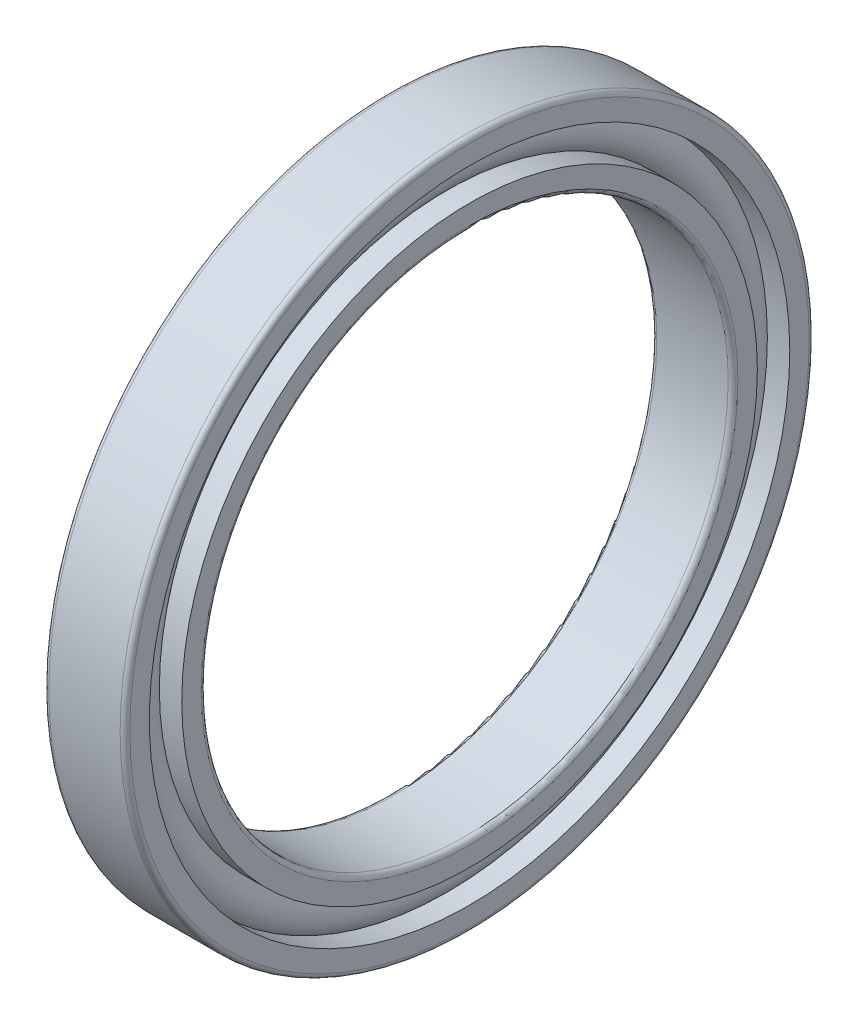
ISO-10303-21;
HEADER;
FILE_DESCRIPTION(('STEP AP214'),'2;1');
FILE_NAME('part.step','',(''),(''),'','','');
FILE_SCHEMA(('AUTOMOTIVE_DESIGN { 1 0 10303 214 1 1 1 1 }'));
ENDSEC;
DATA;
#1=APPLICATION_CONTEXT('core data for automotive mechanical design processes');
#2=APPLICATION_PROTOCOL_DEFINITION('international standard','automotive_design',2000,#1);
#3=PRODUCT_CONTEXT('',#1,'mechanical');
#4=PRODUCT('Part','Part','',(#3));
#5=PRODUCT_RELATED_PRODUCT_CATEGORY('part','',(#4));
#6=PRODUCT_DEFINITION_FORMATION('','',#4);
#7=PRODUCT_DEFINITION_CONTEXT('part definition',#1,'design');
#8=PRODUCT_DEFINITION('design','',#6,#7);
#9=PRODUCT_DEFINITION_SHAPE('','',#8);
#10=(LENGTH_UNIT() NAMED_UNIT(*) SI_UNIT(.MILLI.,.METRE.));
#11=(NAMED_UNIT(*) PLANE_ANGLE_UNIT() SI_UNIT($,.RADIAN.));
#12=(NAMED_UNIT(*) SI_UNIT($,.STERADIAN.) SOLID_ANGLE_UNIT());
#13=UNCERTAINTY_MEASURE_WITH_UNIT(LENGTH_MEASURE(1.E-05),#10,'distance_accuracy_value','');
#14=(GEOMETRIC_REPRESENTATION_CONTEXT(3) GLOBAL_UNCERTAINTY_ASSIGNED_CONTEXT((#13)) GLOBAL_UNIT_ASSIGNED_CONTEXT((#10,
#11,#12)) REPRESENTATION_CONTEXT('',''));
#15=CARTESIAN_POINT('',(0.,0.,0.));
#16=DIRECTION('',(0.,0.,1.));
#17=DIRECTION('',(1.,0.,0.));
#18=AXIS2_PLACEMENT_3D('',#15,#16,#17);
#19=CARTESIAN_POINT('',(0.,0.,0.));
#20=DIRECTION('',(-1.,0.,0.));
#21=DIRECTION('',(0.,0.,1.));
#22=AXIS2_PLACEMENT_3D('',#19,#20,#21);
#23=TOROIDAL_SURFACE('',#22,37.5,3.);
#24=CARTESIAN_POINT('',(2.23606797749978,0.,0.));
#25=DIRECTION('',(-1.,0.,0.));
#26=DIRECTION('',(0.,0.,1.));
#27=AXIS2_PLACEMENT_3D('',#24,#25,#26);
#28=CIRCLE('',#27,39.5);
#29=CARTESIAN_POINT('',(2.23606797749978,0.,39.5));
#30=VERTEX_POINT('',#29);
#31=EDGE_CURVE('E35',#30,#30,#28,.F.);
#32=ORIENTED_EDGE('',*,*,#31,.T.);
#33=EDGE_LOOP('',(#32));
#34=FACE_BOUND('',#33,.T.);
#35=CARTESIAN_POINT('',(2.23606797749978,0.,0.));
#36=DIRECTION('',(-1.,0.,0.));
#37=DIRECTION('',(0.,0.,1.));
#38=AXIS2_PLACEMENT_3D('',#35,#36,#37);
#39=CIRCLE('',#38,35.5);
#40=CARTESIAN_POINT('',(2.23606797749978,0.,35.5));
#41=VERTEX_POINT('',#40);
#42=EDGE_CURVE('E10',#41,#41,#39,.T.);
#43=ORIENTED_EDGE('',*,*,#42,.T.);
#44=EDGE_LOOP('',(#43));
#45=FACE_BOUND('',#44,.T.);
#46=ADVANCED_FACE('F31',(#34,#45),#23,.T.);
#47=CARTESIAN_POINT('',(-20.6375,0.,0.));
#48=DIRECTION('',(1.,0.,0.));
#49=DIRECTION('',(0.,0.,-1.));
#50=AXIS2_PLACEMENT_3D('',#47,#48,#49);
#51=CYLINDRICAL_SURFACE('',#50,35.5);
#52=CARTESIAN_POINT('',(5.,0.,0.));
#53=DIRECTION('',(1.,0.,0.));
#54=DIRECTION('',(0.,0.,-1.));
#55=AXIS2_PLACEMENT_3D('',#52,#53,#54);
#56=CIRCLE('',#55,35.5);
#57=CARTESIAN_POINT('',(5.,0.,-35.5));
#58=VERTEX_POINT('',#57);
#59=EDGE_CURVE('E44',#58,#58,#56,.T.);
#60=ORIENTED_EDGE('',*,*,#59,.F.);
#61=EDGE_LOOP('',(#60));
#62=FACE_BOUND('',#61,.T.);
#63=ORIENTED_EDGE('',*,*,#42,.F.);
#64=EDGE_LOOP('',(#63));
#65=FACE_BOUND('',#64,.T.);
#66=ADVANCED_FACE('F83',(#62,#65),#51,.T.);
#67=CARTESIAN_POINT('',(-20.6375,0.,0.));
#68=DIRECTION('',(1.,0.,0.));
#69=DIRECTION('',(0.,0.,-1.));
#70=AXIS2_PLACEMENT_3D('',#67,#68,#69);
#71=CYLINDRICAL_SURFACE('',#70,35.5);
#72=CARTESIAN_POINT('',(-5.,0.,0.));
#73=DIRECTION('',(1.,0.,0.));
#74=DIRECTION('',(0.,0.,-1.));
#75=AXIS2_PLACEMENT_3D('',#72,#73,#74);
#76=CIRCLE('',#75,35.5);
#77=CARTESIAN_POINT('',(-5.,0.,-35.5));
#78=VERTEX_POINT('',#77);
#79=EDGE_CURVE('E53',#78,#78,#76,.T.);
#80=ORIENTED_EDGE('',*,*,#79,.T.);
#81=EDGE_LOOP('',(#80));
#82=FACE_BOUND('',#81,.T.);
#83=CARTESIAN_POINT('',(-2.23606797749978,0.,0.));
#84=DIRECTION('',(1.,0.,0.));
#85=DIRECTION('',(0.,0.,-1.));
#86=AXIS2_PLACEMENT_3D('',#83,#84,#85);
#87=CIRCLE('',#86,35.5);
#88=CARTESIAN_POINT('',(-2.23606797749978,0.,-35.5));
#89=VERTEX_POINT('',#88);
#90=EDGE_CURVE('E39',#89,#89,#87,.T.);
#91=ORIENTED_EDGE('',*,*,#90,.F.);
#92=EDGE_LOOP('',(#91));
#93=FACE_BOUND('',#92,.T.);
#94=ADVANCED_FACE('F86',(#82,#93),#71,.T.);
#95=CARTESIAN_POINT('',(5.,33.1,0.));
#96=DIRECTION('',(1.,0.,0.));
#97=DIRECTION('',(0.,0.,-1.));
#98=AXIS2_PLACEMENT_3D('',#95,#96,#97);
#99=PLANE('',#98);
#100=ORIENTED_EDGE('',*,*,#59,.T.);
#101=EDGE_LOOP('',(#100));
#102=FACE_BOUND('',#101,.T.);
#103=CARTESIAN_POINT('',(5.,0.,0.));
#104=DIRECTION('',(1.,0.,0.));
#105=DIRECTION('',(0.,0.,-1.));
#106=AXIS2_PLACEMENT_3D('',#103,#104,#105);
#107=CIRCLE('',#106,33.1);
#108=CARTESIAN_POINT('',(5.,0.,-33.1));
#109=VERTEX_POINT('',#108);
#110=EDGE_CURVE('E75',#109,#109,#107,.T.);
#111=ORIENTED_EDGE('',*,*,#110,.F.);
#112=EDGE_LOOP('',(#111));
#113=FACE_BOUND('',#112,.T.);
#114=ADVANCED_FACE('F80',(#102,#113),#99,.T.);
#115=CARTESIAN_POINT('',(4.4,0.,0.));
#116=DIRECTION('',(1.,0.,0.));
#117=DIRECTION('',(0.,0.,-1.));
#118=AXIS2_PLACEMENT_3D('',#115,#116,#117);
#119=TOROIDAL_SURFACE('',#118,33.1,0.600000000000001);
#120=ORIENTED_EDGE('',*,*,#110,.T.);
#121=EDGE_LOOP('',(#120));
#122=FACE_BOUND('',#121,.T.);
#123=CARTESIAN_POINT('',(4.4,0.,0.));
#124=DIRECTION('',(1.,0.,0.));
#125=DIRECTION('',(0.,0.,-1.));
#126=AXIS2_PLACEMENT_3D('',#123,#124,#125);
#127=CIRCLE('',#126,32.5);
#128=CARTESIAN_POINT('',(4.4,0.,-32.5));
#129=VERTEX_POINT('',#128);
#130=EDGE_CURVE('E72',#129,#129,#127,.T.);
#131=ORIENTED_EDGE('',*,*,#130,.F.);
#132=EDGE_LOOP('',(#131));
#133=FACE_BOUND('',#132,.T.);
#134=ADVANCED_FACE('F97',(#122,#133),#119,.T.);
#135=CARTESIAN_POINT('',(-20.6375,0.,0.));
#136=DIRECTION('',(1.,0.,0.));
#137=DIRECTION('',(0.,0.,-1.));
#138=AXIS2_PLACEMENT_3D('',#135,#136,#137);
#139=CYLINDRICAL_SURFACE('',#138,32.5);
#140=ORIENTED_EDGE('',*,*,#130,.T.);
#141=EDGE_LOOP('',(#140));
#142=FACE_BOUND('',#141,.T.);
#143=CARTESIAN_POINT('',(-4.4,0.,0.));
#144=DIRECTION('',(1.,0.,0.));
#145=DIRECTION('',(0.,0.,-1.));
#146=AXIS2_PLACEMENT_3D('',#143,#144,#145);
#147=CIRCLE('',#146,32.5);
#148=CARTESIAN_POINT('',(-4.4,0.,-32.5));
#149=VERTEX_POINT('',#148);
#150=EDGE_CURVE('E69',#149,#149,#147,.T.);
#151=ORIENTED_EDGE('',*,*,#150,.F.);
#152=EDGE_LOOP('',(#151));
#153=FACE_BOUND('',#152,.T.);
#154=ADVANCED_FACE('F100',(#142,#153),#139,.F.);
#155=CARTESIAN_POINT('',(-4.4,0.,0.));
#156=DIRECTION('',(1.,0.,0.));
#157=DIRECTION('',(0.,0.,-1.));
#158=AXIS2_PLACEMENT_3D('',#155,#156,#157);
#159=TOROIDAL_SURFACE('',#158,33.1,0.600000000000001);
#160=ORIENTED_EDGE('',*,*,#150,.T.);
#161=EDGE_LOOP('',(#160));
#162=FACE_BOUND('',#161,.T.);
#163=CARTESIAN_POINT('',(-5.,0.,0.));
#164=DIRECTION('',(1.,0.,0.));
#165=DIRECTION('',(0.,0.,-1.));
#166=AXIS2_PLACEMENT_3D('',#163,#164,#165);
#167=CIRCLE('',#166,33.1);
#168=CARTESIAN_POINT('',(-5.,0.,-33.1));
#169=VERTEX_POINT('',#168);
#170=EDGE_CURVE('E66',#169,#169,#167,.T.);
#171=ORIENTED_EDGE('',*,*,#170,.F.);
#172=EDGE_LOOP('',(#171));
#173=FACE_BOUND('',#172,.T.);
#174=ADVANCED_FACE('F104',(#162,#173),#159,.T.);
#175=CARTESIAN_POINT('',(-5.,35.5,0.));
#176=DIRECTION('',(-1.,0.,0.));
#177=DIRECTION('',(0.,0.,1.));
#178=AXIS2_PLACEMENT_3D('',#175,#176,#177);
#179=PLANE('',#178);
#180=ORIENTED_EDGE('',*,*,#170,.T.);
#181=EDGE_LOOP('',(#180));
#182=FACE_BOUND('',#181,.T.);
#183=ORIENTED_EDGE('',*,*,#79,.F.);
#184=EDGE_LOOP('',(#183));
#185=FACE_BOUND('',#184,.T.);
#186=ADVANCED_FACE('F108',(#182,#185),#179,.T.);
#187=CARTESIAN_POINT('',(-2.23606797749978,0.,0.));
#188=DIRECTION('',(1.,0.,0.));
#189=DIRECTION('',(0.,0.,-1.));
#190=AXIS2_PLACEMENT_3D('',#187,#188,#189);
#191=CIRCLE('',#190,39.5);
#192=CARTESIAN_POINT('',(-2.23606797749978,0.,-39.5));
#193=VERTEX_POINT('',#192);
#194=EDGE_CURVE('E47',#193,#193,#191,.F.);
#195=ORIENTED_EDGE('',*,*,#194,.T.);
#196=EDGE_LOOP('',(#195));
#197=FACE_BOUND('',#196,.T.);
#198=ORIENTED_EDGE('',*,*,#90,.T.);
#199=EDGE_LOOP('',(#198));
#200=FACE_BOUND('',#199,.T.);
#201=ADVANCED_FACE('F33',(#197,#200),#23,.T.);
#202=CARTESIAN_POINT('',(-20.6375,0.,0.));
#203=DIRECTION('',(1.,0.,0.));
#204=DIRECTION('',(0.,0.,-1.));
#205=AXIS2_PLACEMENT_3D('',#202,#203,#204);
#206=CYLINDRICAL_SURFACE('',#205,39.5);
#207=CARTESIAN_POINT('',(5.,0.,0.));
#208=DIRECTION('',(1.,0.,0.));
#209=DIRECTION('',(0.,0.,-1.));
#210=AXIS2_PLACEMENT_3D('',#207,#208,#209);
#211=CIRCLE('',#210,39.5);
#212=CARTESIAN_POINT('',(5.,0.,-39.5));
#213=VERTEX_POINT('',#212);
#214=EDGE_CURVE('E49',#213,#213,#211,.T.);
#215=ORIENTED_EDGE('',*,*,#214,.T.);
#216=EDGE_LOOP('',(#215));
#217=FACE_BOUND('',#216,.T.);
#218=ORIENTED_EDGE('',*,*,#31,.F.);
#219=EDGE_LOOP('',(#218));
#220=FACE_BOUND('',#219,.T.);
#221=ADVANCED_FACE('F113',(#217,#220),#206,.F.);
#222=CARTESIAN_POINT('',(-20.6375,0.,0.));
#223=DIRECTION('',(1.,0.,0.));
#224=DIRECTION('',(0.,0.,-1.));
#225=AXIS2_PLACEMENT_3D('',#222,#223,#224);
#226=CYLINDRICAL_SURFACE('',#225,39.5);
#227=CARTESIAN_POINT('',(-5.,0.,0.));
#228=DIRECTION('',(1.,0.,0.));
#229=DIRECTION('',(0.,0.,-1.));
#230=AXIS2_PLACEMENT_3D('',#227,#228,#229);
#231=CIRCLE('',#230,39.5);
#232=CARTESIAN_POINT('',(-5.,0.,-39.5));
#233=VERTEX_POINT('',#232);
#234=EDGE_CURVE('E144',#233,#233,#231,.T.);
#235=ORIENTED_EDGE('',*,*,#234,.F.);
#236=EDGE_LOOP('',(#235));
#237=FACE_BOUND('',#236,.T.);
#238=ORIENTED_EDGE('',*,*,#194,.F.);
#239=EDGE_LOOP('',(#238));
#240=FACE_BOUND('',#239,.T.);
#241=ADVANCED_FACE('F116',(#237,#240),#226,.F.);
#242=CARTESIAN_POINT('',(5.,41.9,0.));
#243=DIRECTION('',(1.,0.,0.));
#244=DIRECTION('',(0.,0.,-1.));
#245=AXIS2_PLACEMENT_3D('',#242,#243,#244);
#246=PLANE('',#245);
#247=CARTESIAN_POINT('',(5.,0.,0.));
#248=DIRECTION('',(1.,0.,0.));
#249=DIRECTION('',(0.,0.,-1.));
#250=AXIS2_PLACEMENT_3D('',#247,#248,#249);
#251=CIRCLE('',#250,41.9);
#252=CARTESIAN_POINT('',(5.,0.,-41.9));
#253=VERTEX_POINT('',#252);
#254=EDGE_CURVE('E55',#253,#253,#251,.T.);
#255=ORIENTED_EDGE('',*,*,#254,.T.);
#256=EDGE_LOOP('',(#255));
#257=FACE_BOUND('',#256,.T.);
#258=ORIENTED_EDGE('',*,*,#214,.F.);
#259=EDGE_LOOP('',(#258));
#260=FACE_BOUND('',#259,.T.);
#261=ADVANCED_FACE('F117',(#257,#260),#246,.T.);
#262=CARTESIAN_POINT('',(4.4,0.,0.));
#263=DIRECTION('',(1.,0.,0.));
#264=DIRECTION('',(0.,0.,-1.));
#265=AXIS2_PLACEMENT_3D('',#262,#263,#264);
#266=TOROIDAL_SURFACE('',#265,41.9,0.600000000000003);
#267=CARTESIAN_POINT('',(4.4,0.,0.));
#268=DIRECTION('',(1.,0.,0.));
#269=DIRECTION('',(0.,0.,-1.));
#270=AXIS2_PLACEMENT_3D('',#267,#268,#269);
#271=CIRCLE('',#270,42.5);
#272=CARTESIAN_POINT('',(4.4,0.,-42.5));
#273=VERTEX_POINT('',#272);
#274=EDGE_CURVE('E60',#273,#273,#271,.T.);
#275=ORIENTED_EDGE('',*,*,#274,.T.);
#276=EDGE_LOOP('',(#275));
#277=FACE_BOUND('',#276,.T.);
#278=ORIENTED_EDGE('',*,*,#254,.F.);
#279=EDGE_LOOP('',(#278));
#280=FACE_BOUND('',#279,.T.);
#281=ADVANCED_FACE('F120',(#277,#280),#266,.T.);
#282=CARTESIAN_POINT('',(-20.6375,0.,0.));
#283=DIRECTION('',(1.,0.,0.));
#284=DIRECTION('',(0.,0.,-1.));
#285=AXIS2_PLACEMENT_3D('',#282,#283,#284);
#286=CYLINDRICAL_SURFACE('',#285,42.5);
#287=CARTESIAN_POINT('',(-4.4,0.,0.));
#288=DIRECTION('',(1.,0.,0.));
#289=DIRECTION('',(0.,0.,-1.));
#290=AXIS2_PLACEMENT_3D('',#287,#288,#289);
#291=CIRCLE('',#290,42.5);
#292=CARTESIAN_POINT('',(-4.4,0.,-42.5));
#293=VERTEX_POINT('',#292);
#294=EDGE_CURVE('E148',#293,#293,#291,.T.);
#295=ORIENTED_EDGE('',*,*,#294,.T.);
#296=EDGE_LOOP('',(#295));
#297=FACE_BOUND('',#296,.T.);
#298=ORIENTED_EDGE('',*,*,#274,.F.);
#299=EDGE_LOOP('',(#298));
#300=FACE_BOUND('',#299,.T.);
#301=ADVANCED_FACE('F124',(#297,#300),#286,.T.);
#302=CARTESIAN_POINT('',(-4.4,0.,0.));
#303=DIRECTION('',(1.,0.,0.));
#304=DIRECTION('',(0.,0.,-1.));
#305=AXIS2_PLACEMENT_3D('',#302,#303,#304);
#306=TOROIDAL_SURFACE('',#305,41.9,0.600000000000003);
#307=CARTESIAN_POINT('',(-5.,0.,0.));
#308=DIRECTION('',(1.,0.,0.));
#309=DIRECTION('',(0.,0.,-1.));
#310=AXIS2_PLACEMENT_3D('',#307,#308,#309);
#311=CIRCLE('',#310,41.9);
#312=CARTESIAN_POINT('',(-5.,0.,-41.9));
#313=VERTEX_POINT('',#312);
#314=EDGE_CURVE('E145',#313,#313,#311,.T.);
#315=ORIENTED_EDGE('',*,*,#314,.T.);
#316=EDGE_LOOP('',(#315));
#317=FACE_BOUND('',#316,.T.);
#318=ORIENTED_EDGE('',*,*,#294,.F.);
#319=EDGE_LOOP('',(#318));
#320=FACE_BOUND('',#319,.T.);
#321=ADVANCED_FACE('F128',(#317,#320),#306,.T.);
#322=CARTESIAN_POINT('',(-5.,39.5,0.));
#323=DIRECTION('',(-1.,0.,0.));
#324=DIRECTION('',(0.,0.,1.));
#325=AXIS2_PLACEMENT_3D('',#322,#323,#324);
#326=PLANE('',#325);
#327=ORIENTED_EDGE('',*,*,#234,.T.);
#328=EDGE_LOOP('',(#327));
#329=FACE_BOUND('',#328,.T.);
#330=ORIENTED_EDGE('',*,*,#314,.F.);
#331=EDGE_LOOP('',(#330));
#332=FACE_BOUND('',#331,.T.);
#333=ADVANCED_FACE('F132',(#329,#332),#326,.T.);
#334=CLOSED_SHELL('',(#46,#66,#94,#114,#134,#154,#174,#186,#201,#221,#241,#261,#281,#301,#321,#333));
#335=MANIFOLD_SOLID_BREP('B2',#334);
#336=ADVANCED_BREP_SHAPE_REPRESENTATION('',(#18,#335),#14);
#337=SHAPE_DEFINITION_REPRESENTATION(#9,#336);
ENDSEC;
END-ISO-10303-21;
